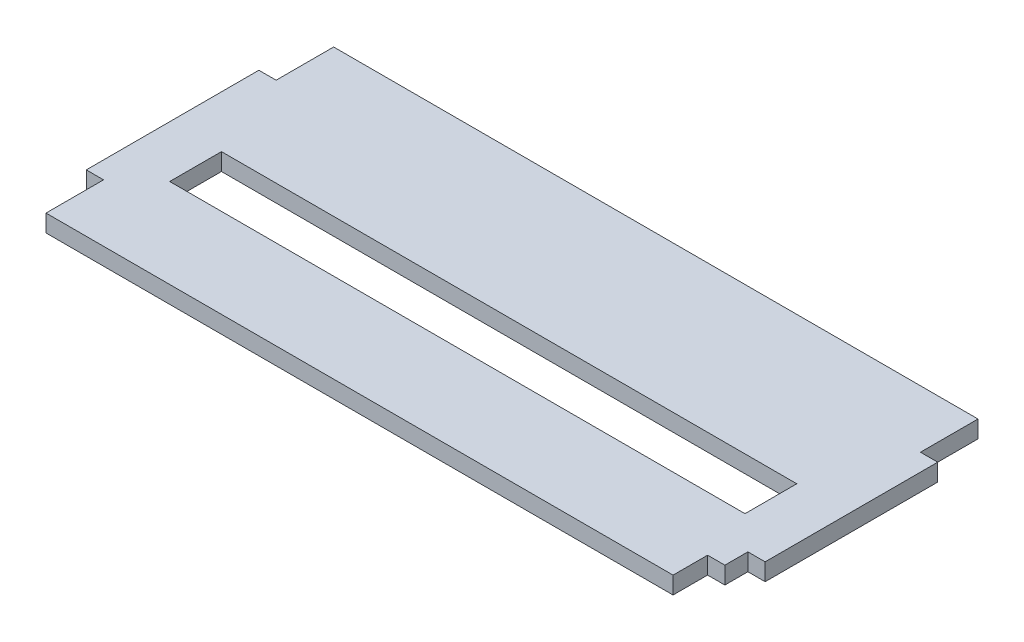
ISO-10303-21;
HEADER;
FILE_DESCRIPTION(('STEP AP214'),'2;1');
FILE_NAME('part.step','',(''),(''),'','','');
FILE_SCHEMA(('AUTOMOTIVE_DESIGN { 1 0 10303 214 1 1 1 1 }'));
ENDSEC;
DATA;
#1=APPLICATION_CONTEXT('core data for automotive mechanical design processes');
#2=APPLICATION_PROTOCOL_DEFINITION('international standard','automotive_design',2000,#1);
#3=PRODUCT_CONTEXT('',#1,'mechanical');
#4=PRODUCT('Part','Part','',(#3));
#5=PRODUCT_RELATED_PRODUCT_CATEGORY('part','',(#4));
#6=PRODUCT_DEFINITION_FORMATION('','',#4);
#7=PRODUCT_DEFINITION_CONTEXT('part definition',#1,'design');
#8=PRODUCT_DEFINITION('design','',#6,#7);
#9=PRODUCT_DEFINITION_SHAPE('','',#8);
#10=(LENGTH_UNIT() NAMED_UNIT(*) SI_UNIT(.MILLI.,.METRE.));
#11=(NAMED_UNIT(*) PLANE_ANGLE_UNIT() SI_UNIT($,.RADIAN.));
#12=(NAMED_UNIT(*) SI_UNIT($,.STERADIAN.) SOLID_ANGLE_UNIT());
#13=UNCERTAINTY_MEASURE_WITH_UNIT(LENGTH_MEASURE(1.E-05),#10,'distance_accuracy_value','');
#14=(GEOMETRIC_REPRESENTATION_CONTEXT(3) GLOBAL_UNCERTAINTY_ASSIGNED_CONTEXT((#13)) GLOBAL_UNIT_ASSIGNED_CONTEXT((#10,
#11,#12)) REPRESENTATION_CONTEXT('',''));
#15=CARTESIAN_POINT('',(0.,0.,0.));
#16=DIRECTION('',(0.,0.,1.));
#17=DIRECTION('',(1.,0.,0.));
#18=AXIS2_PLACEMENT_3D('',#15,#16,#17);
#19=CARTESIAN_POINT('',(-1.55431223447522E-12,12.,139.999999999999));
#20=DIRECTION('',(0.,0.,-1.));
#21=DIRECTION('',(-1.,0.,0.));
#22=AXIS2_PLACEMENT_3D('',#19,#20,#21);
#23=PLANE('',#22);
#24=DIRECTION('',(1.,0.,0.));
#25=VECTOR('',#24,1.);
#26=CARTESIAN_POINT('',(-1.55431223447522E-12,3.,139.999999999999));
#27=LINE('',#26,#25);
#28=CARTESIAN_POINT('',(-3.00000000000156,3.,139.999999999999));
#29=VERTEX_POINT('',#28);
#30=CARTESIAN_POINT('',(-1.55431223447522E-12,3.,139.999999999999));
#31=VERTEX_POINT('',#30);
#32=EDGE_CURVE('E234',#29,#31,#27,.T.);
#33=ORIENTED_EDGE('',*,*,#32,.F.);
#34=DIRECTION('',(0.,1.,0.));
#35=VECTOR('',#34,1.);
#36=CARTESIAN_POINT('',(-3.00000000000156,0.,139.999999999999));
#37=LINE('',#36,#35);
#38=CARTESIAN_POINT('',(-3.00000000000156,0.,139.999999999999));
#39=VERTEX_POINT('',#38);
#40=EDGE_CURVE('E298',#39,#29,#37,.T.);
#41=ORIENTED_EDGE('',*,*,#40,.F.);
#42=DIRECTION('',(1.,0.,0.));
#43=VECTOR('',#42,1.);
#44=CARTESIAN_POINT('',(-1.55431223447522E-12,0.,139.999999999999));
#45=LINE('',#44,#43);
#46=CARTESIAN_POINT('',(-1.55431223447522E-12,0.,139.999999999999));
#47=VERTEX_POINT('',#46);
#48=EDGE_CURVE('E319',#39,#47,#45,.T.);
#49=ORIENTED_EDGE('',*,*,#48,.T.);
#50=DIRECTION('',(0.,1.,0.));
#51=VECTOR('',#50,1.);
#52=CARTESIAN_POINT('',(-1.55431223447522E-12,0.,139.999999999999));
#53=LINE('',#52,#51);
#54=EDGE_CURVE('E261',#47,#31,#53,.T.);
#55=ORIENTED_EDGE('',*,*,#54,.T.);
#56=EDGE_LOOP('',(#33,#41,#49,#55));
#57=FACE_BOUND('',#56,.T.);
#58=ADVANCED_FACE('F40',(#57),#23,.F.);
#59=CARTESIAN_POINT('',(-1.60982338570648E-12,12.,109.999999999999));
#60=DIRECTION('',(0.,0.,-1.));
#61=DIRECTION('',(-1.,0.,0.));
#62=AXIS2_PLACEMENT_3D('',#59,#60,#61);
#63=PLANE('',#62);
#64=DIRECTION('',(0.,1.,0.));
#65=VECTOR('',#64,1.);
#66=CARTESIAN_POINT('',(-2.99999999999845,0.,109.999999999999));
#67=LINE('',#66,#65);
#68=CARTESIAN_POINT('',(-2.99999999999845,0.,109.999999999999));
#69=VERTEX_POINT('',#68);
#70=CARTESIAN_POINT('',(-2.99999999999845,3.,109.999999999999));
#71=VERTEX_POINT('',#70);
#72=EDGE_CURVE('E341',#69,#71,#67,.T.);
#73=ORIENTED_EDGE('',*,*,#72,.T.);
#74=DIRECTION('',(1.,0.,0.));
#75=VECTOR('',#74,1.);
#76=CARTESIAN_POINT('',(-1.60982338570648E-12,3.,109.999999999999));
#77=LINE('',#76,#75);
#78=CARTESIAN_POINT('',(-1.55431223447522E-12,3.,109.999999999999));
#79=VERTEX_POINT('',#78);
#80=EDGE_CURVE('E240',#71,#79,#77,.T.);
#81=ORIENTED_EDGE('',*,*,#80,.T.);
#82=DIRECTION('',(0.,1.,0.));
#83=VECTOR('',#82,1.);
#84=CARTESIAN_POINT('',(-3.33066907387547E-13,0.,109.999999999999));
#85=LINE('',#84,#83);
#86=CARTESIAN_POINT('',(-1.55431223447522E-12,0.,109.999999999999));
#87=VERTEX_POINT('',#86);
#88=EDGE_CURVE('E262',#87,#79,#85,.T.);
#89=ORIENTED_EDGE('',*,*,#88,.F.);
#90=DIRECTION('',(1.,0.,0.));
#91=VECTOR('',#90,1.);
#92=CARTESIAN_POINT('',(-1.60982338570648E-12,0.,109.999999999999));
#93=LINE('',#92,#91);
#94=EDGE_CURVE('E351',#69,#87,#93,.T.);
#95=ORIENTED_EDGE('',*,*,#94,.F.);
#96=EDGE_LOOP('',(#73,#81,#89,#95));
#97=FACE_BOUND('',#96,.T.);
#98=ADVANCED_FACE('F398',(#97),#63,.T.);
#99=CARTESIAN_POINT('',(-118.000000000001,12.,109.999999999999));
#100=DIRECTION('',(0.,0.,1.));
#101=DIRECTION('',(1.,0.,0.));
#102=AXIS2_PLACEMENT_3D('',#99,#100,#101);
#103=PLANE('',#102);
#104=DIRECTION('',(-1.,0.,0.));
#105=VECTOR('',#104,1.);
#106=CARTESIAN_POINT('',(-118.000000000001,3.,109.999999999999));
#107=LINE('',#106,#105);
#108=CARTESIAN_POINT('',(-115.000000000005,3.,109.999999999999));
#109=VERTEX_POINT('',#108);
#110=CARTESIAN_POINT('',(-118.000000000002,3.,109.999999999999));
#111=VERTEX_POINT('',#110);
#112=EDGE_CURVE('E248',#109,#111,#107,.T.);
#113=ORIENTED_EDGE('',*,*,#112,.F.);
#114=DIRECTION('',(0.,1.,0.));
#115=VECTOR('',#114,1.);
#116=CARTESIAN_POINT('',(-115.000000000005,0.,109.999999999999));
#117=LINE('',#116,#115);
#118=CARTESIAN_POINT('',(-115.000000000005,0.,109.999999999999));
#119=VERTEX_POINT('',#118);
#120=EDGE_CURVE('E337',#119,#109,#117,.T.);
#121=ORIENTED_EDGE('',*,*,#120,.F.);
#122=DIRECTION('',(-1.,0.,0.));
#123=VECTOR('',#122,1.);
#124=CARTESIAN_POINT('',(-118.000000000001,0.,109.999999999999));
#125=LINE('',#124,#123);
#126=CARTESIAN_POINT('',(-118.000000000001,0.,109.999999999999));
#127=VERTEX_POINT('',#126);
#128=EDGE_CURVE('E355',#119,#127,#125,.T.);
#129=ORIENTED_EDGE('',*,*,#128,.T.);
#130=DIRECTION('',(0.,1.,0.));
#131=VECTOR('',#130,1.);
#132=CARTESIAN_POINT('',(-118.000000000001,0.,109.999999999999));
#133=LINE('',#132,#131);
#134=EDGE_CURVE('E274',#127,#111,#133,.T.);
#135=ORIENTED_EDGE('',*,*,#134,.T.);
#136=EDGE_LOOP('',(#113,#121,#129,#135));
#137=FACE_BOUND('',#136,.T.);
#138=ADVANCED_FACE('F384',(#137),#103,.F.);
#139=CARTESIAN_POINT('',(-118.000000000002,12.,139.999999999999));
#140=DIRECTION('',(0.,0.,1.));
#141=DIRECTION('',(1.,0.,0.));
#142=AXIS2_PLACEMENT_3D('',#139,#140,#141);
#143=PLANE('',#142);
#144=DIRECTION('',(0.,1.,0.));
#145=VECTOR('',#144,1.);
#146=CARTESIAN_POINT('',(-115.000000000002,0.,139.999999999999));
#147=LINE('',#146,#145);
#148=CARTESIAN_POINT('',(-115.000000000002,0.,139.999999999999));
#149=VERTEX_POINT('',#148);
#150=CARTESIAN_POINT('',(-115.000000000002,3.,139.999999999999));
#151=VERTEX_POINT('',#150);
#152=EDGE_CURVE('E313',#149,#151,#147,.T.);
#153=ORIENTED_EDGE('',*,*,#152,.T.);
#154=DIRECTION('',(-1.,0.,0.));
#155=VECTOR('',#154,1.);
#156=CARTESIAN_POINT('',(-118.000000000002,3.,139.999999999999));
#157=LINE('',#156,#155);
#158=CARTESIAN_POINT('',(-118.000000000002,3.,139.999999999999));
#159=VERTEX_POINT('',#158);
#160=EDGE_CURVE('E254',#151,#159,#157,.T.);
#161=ORIENTED_EDGE('',*,*,#160,.T.);
#162=DIRECTION('',(0.,1.,0.));
#163=VECTOR('',#162,1.);
#164=CARTESIAN_POINT('',(-118.000000000002,0.,139.999999999999));
#165=LINE('',#164,#163);
#166=CARTESIAN_POINT('',(-118.000000000001,0.,139.999999999999));
#167=VERTEX_POINT('',#166);
#168=EDGE_CURVE('E273',#167,#159,#165,.T.);
#169=ORIENTED_EDGE('',*,*,#168,.F.);
#170=DIRECTION('',(-1.,0.,0.));
#171=VECTOR('',#170,1.);
#172=CARTESIAN_POINT('',(-118.000000000002,0.,139.999999999999));
#173=LINE('',#172,#171);
#174=EDGE_CURVE('E359',#149,#167,#173,.T.);
#175=ORIENTED_EDGE('',*,*,#174,.F.);
#176=EDGE_LOOP('',(#153,#161,#169,#175));
#177=FACE_BOUND('',#176,.T.);
#178=ADVANCED_FACE('F377',(#177),#143,.T.);
#179=CARTESIAN_POINT('',(-1.60982338570648E-12,12.,149.999999999999));
#180=DIRECTION('',(0.,0.,1.));
#181=DIRECTION('',(1.,0.,0.));
#182=AXIS2_PLACEMENT_3D('',#179,#180,#181);
#183=PLANE('',#182);
#184=DIRECTION('',(0.,1.,0.));
#185=VECTOR('',#184,1.);
#186=CARTESIAN_POINT('',(-6.00197015274362,0.,149.999999999999));
#187=LINE('',#186,#185);
#188=CARTESIAN_POINT('',(-6.00197015274362,0.,149.999999999999));
#189=VERTEX_POINT('',#188);
#190=CARTESIAN_POINT('',(-6.00197015274362,3.,149.999999999999));
#191=VERTEX_POINT('',#190);
#192=EDGE_CURVE('E302',#189,#191,#187,.T.);
#193=ORIENTED_EDGE('',*,*,#192,.T.);
#194=DIRECTION('',(1.,0.,0.));
#195=VECTOR('',#194,1.);
#196=CARTESIAN_POINT('',(-118.000000000002,3.,149.999999999999));
#197=LINE('',#196,#195);
#198=CARTESIAN_POINT('',(-115.000000000002,3.,149.999999999999));
#199=VERTEX_POINT('',#198);
#200=EDGE_CURVE('E217',#199,#191,#197,.T.);
#201=ORIENTED_EDGE('',*,*,#200,.F.);
#202=DIRECTION('',(0.,1.,0.));
#203=VECTOR('',#202,1.);
#204=CARTESIAN_POINT('',(-115.000000000002,0.,149.999999999999));
#205=LINE('',#204,#203);
#206=CARTESIAN_POINT('',(-115.000000000002,0.,149.999999999999));
#207=VERTEX_POINT('',#206);
#208=EDGE_CURVE('E315',#207,#199,#205,.T.);
#209=ORIENTED_EDGE('',*,*,#208,.F.);
#210=DIRECTION('',(-1.,0.,0.));
#211=VECTOR('',#210,1.);
#212=CARTESIAN_POINT('',(-1.60982338570648E-12,0.,149.999999999999));
#213=LINE('',#212,#211);
#214=EDGE_CURVE('E48',#189,#207,#213,.T.);
#215=ORIENTED_EDGE('',*,*,#214,.F.);
#216=EDGE_LOOP('',(#193,#201,#209,#215));
#217=FACE_BOUND('',#216,.T.);
#218=ADVANCED_FACE('F370',(#217),#183,.T.);
#219=CARTESIAN_POINT('',(-115.000000000002,0.,0.));
#220=DIRECTION('',(1.,0.,0.));
#221=DIRECTION('',(0.,0.,-1.));
#222=AXIS2_PLACEMENT_3D('',#219,#220,#221);
#223=PLANE('',#222);
#224=DIRECTION('',(0.,0.,1.));
#225=VECTOR('',#224,1.);
#226=CARTESIAN_POINT('',(-115.000000000002,3.,0.));
#227=LINE('',#226,#225);
#228=EDGE_CURVE('E251',#151,#199,#227,.T.);
#229=ORIENTED_EDGE('',*,*,#228,.F.);
#230=ORIENTED_EDGE('',*,*,#152,.F.);
#231=DIRECTION('',(0.,0.,-1.));
#232=VECTOR('',#231,1.);
#233=CARTESIAN_POINT('',(-115.000000000002,0.,0.));
#234=LINE('',#233,#232);
#235=EDGE_CURVE('E309',#207,#149,#234,.T.);
#236=ORIENTED_EDGE('',*,*,#235,.F.);
#237=ORIENTED_EDGE('',*,*,#208,.T.);
#238=EDGE_LOOP('',(#229,#230,#236,#237));
#239=FACE_BOUND('',#238,.T.);
#240=ADVANCED_FACE('F374',(#239),#223,.F.);
#241=CARTESIAN_POINT('',(0.,0.,99.9999999999988));
#242=DIRECTION('',(0.,0.,-1.));
#243=DIRECTION('',(-1.,0.,0.));
#244=AXIS2_PLACEMENT_3D('',#241,#242,#243);
#245=PLANE('',#244);
#246=DIRECTION('',(0.,1.,0.));
#247=VECTOR('',#246,1.);
#248=CARTESIAN_POINT('',(-115.000000000005,0.,99.9999999999989));
#249=LINE('',#248,#247);
#250=CARTESIAN_POINT('',(-115.000000000005,0.,99.9999999999989));
#251=VERTEX_POINT('',#250);
#252=CARTESIAN_POINT('',(-115.000000000005,3.,99.9999999999989));
#253=VERTEX_POINT('',#252);
#254=EDGE_CURVE('E314',#251,#253,#249,.T.);
#255=ORIENTED_EDGE('',*,*,#254,.T.);
#256=DIRECTION('',(-1.,0.,0.));
#257=VECTOR('',#256,1.);
#258=CARTESIAN_POINT('',(-118.000000000002,3.,99.9999999999989));
#259=LINE('',#258,#257);
#260=CARTESIAN_POINT('',(-2.9999999999985,3.,99.9999999999989));
#261=VERTEX_POINT('',#260);
#262=EDGE_CURVE('E220',#261,#253,#259,.T.);
#263=ORIENTED_EDGE('',*,*,#262,.F.);
#264=DIRECTION('',(0.,1.,0.));
#265=VECTOR('',#264,1.);
#266=CARTESIAN_POINT('',(-2.9999999999985,0.,99.9999999999989));
#267=LINE('',#266,#265);
#268=CARTESIAN_POINT('',(-2.9999999999985,0.,99.9999999999989));
#269=VERTEX_POINT('',#268);
#270=EDGE_CURVE('E333',#269,#261,#267,.T.);
#271=ORIENTED_EDGE('',*,*,#270,.F.);
#272=DIRECTION('',(-1.,0.,0.));
#273=VECTOR('',#272,1.);
#274=CARTESIAN_POINT('',(0.,0.,99.9999999999988));
#275=LINE('',#274,#273);
#276=EDGE_CURVE('E297',#269,#251,#275,.T.);
#277=ORIENTED_EDGE('',*,*,#276,.T.);
#278=EDGE_LOOP('',(#255,#263,#271,#277));
#279=FACE_BOUND('',#278,.T.);
#280=ADVANCED_FACE('F391',(#279),#245,.T.);
#281=CARTESIAN_POINT('',(-115.000000000005,0.,0.));
#282=DIRECTION('',(-1.,0.,0.));
#283=DIRECTION('',(0.,0.,1.));
#284=AXIS2_PLACEMENT_3D('',#281,#282,#283);
#285=PLANE('',#284);
#286=ORIENTED_EDGE('',*,*,#120,.T.);
#287=DIRECTION('',(0.,0.,-1.));
#288=VECTOR('',#287,1.);
#289=CARTESIAN_POINT('',(-115.000000000005,3.,0.));
#290=LINE('',#289,#288);
#291=EDGE_CURVE('E244',#109,#253,#290,.T.);
#292=ORIENTED_EDGE('',*,*,#291,.T.);
#293=ORIENTED_EDGE('',*,*,#254,.F.);
#294=DIRECTION('',(0.,0.,1.));
#295=VECTOR('',#294,1.);
#296=CARTESIAN_POINT('',(-115.000000000005,0.,0.));
#297=LINE('',#296,#295);
#298=EDGE_CURVE('E329',#251,#119,#297,.T.);
#299=ORIENTED_EDGE('',*,*,#298,.T.);
#300=EDGE_LOOP('',(#286,#292,#293,#299));
#301=FACE_BOUND('',#300,.T.);
#302=ADVANCED_FACE('F386',(#301),#285,.T.);
#303=CARTESIAN_POINT('',(-2.99999999999845,0.,0.));
#304=DIRECTION('',(-1.,0.,0.));
#305=DIRECTION('',(0.,0.,1.));
#306=AXIS2_PLACEMENT_3D('',#303,#304,#305);
#307=PLANE('',#306);
#308=DIRECTION('',(0.,0.,-1.));
#309=VECTOR('',#308,1.);
#310=CARTESIAN_POINT('',(-2.99999999999845,3.,0.));
#311=LINE('',#310,#309);
#312=EDGE_CURVE('E237',#71,#261,#311,.T.);
#313=ORIENTED_EDGE('',*,*,#312,.F.);
#314=ORIENTED_EDGE('',*,*,#72,.F.);
#315=DIRECTION('',(0.,0.,1.));
#316=VECTOR('',#315,1.);
#317=CARTESIAN_POINT('',(-2.99999999999845,0.,0.));
#318=LINE('',#317,#316);
#319=EDGE_CURVE('E325',#269,#69,#318,.T.);
#320=ORIENTED_EDGE('',*,*,#319,.F.);
#321=ORIENTED_EDGE('',*,*,#270,.T.);
#322=EDGE_LOOP('',(#313,#314,#320,#321));
#323=FACE_BOUND('',#322,.T.);
#324=ADVANCED_FACE('F396',(#323),#307,.F.);
#325=CARTESIAN_POINT('',(0.,0.,143.999999999999));
#326=DIRECTION('',(0.,0.,1.));
#327=DIRECTION('',(1.,0.,0.));
#328=AXIS2_PLACEMENT_3D('',#325,#326,#327);
#329=PLANE('',#328);
#330=DIRECTION('',(0.,1.,0.));
#331=VECTOR('',#330,1.);
#332=CARTESIAN_POINT('',(-3.00000000000156,0.,143.999999999999));
#333=LINE('',#332,#331);
#334=CARTESIAN_POINT('',(-3.00000000000156,0.,143.999999999999));
#335=VERTEX_POINT('',#334);
#336=CARTESIAN_POINT('',(-3.00000000000156,3.,143.999999999999));
#337=VERTEX_POINT('',#336);
#338=EDGE_CURVE('E293',#335,#337,#333,.T.);
#339=ORIENTED_EDGE('',*,*,#338,.T.);
#340=DIRECTION('',(-1.,0.,0.));
#341=VECTOR('',#340,1.);
#342=CARTESIAN_POINT('',(0.,3.,143.999999999999));
#343=LINE('',#342,#341);
#344=CARTESIAN_POINT('',(-6.00197015274351,3.,143.999999999999));
#345=VERTEX_POINT('',#344);
#346=EDGE_CURVE('E226',#337,#345,#343,.T.);
#347=ORIENTED_EDGE('',*,*,#346,.T.);
#348=DIRECTION('',(0.,1.,0.));
#349=VECTOR('',#348,1.);
#350=CARTESIAN_POINT('',(-6.00197015274351,0.,143.999999999999));
#351=LINE('',#350,#349);
#352=CARTESIAN_POINT('',(-6.00197015274351,0.,143.999999999999));
#353=VERTEX_POINT('',#352);
#354=EDGE_CURVE('E292',#353,#345,#351,.T.);
#355=ORIENTED_EDGE('',*,*,#354,.F.);
#356=DIRECTION('',(1.,0.,0.));
#357=VECTOR('',#356,1.);
#358=CARTESIAN_POINT('',(0.,0.,143.999999999999));
#359=LINE('',#358,#357);
#360=EDGE_CURVE('E278',#353,#335,#359,.T.);
#361=ORIENTED_EDGE('',*,*,#360,.T.);
#362=EDGE_LOOP('',(#339,#347,#355,#361));
#363=FACE_BOUND('',#362,.T.);
#364=ADVANCED_FACE('F410',(#363),#329,.T.);
#365=CARTESIAN_POINT('',(-3.00000000000156,0.,0.));
#366=DIRECTION('',(1.,0.,0.));
#367=DIRECTION('',(0.,0.,-1.));
#368=AXIS2_PLACEMENT_3D('',#365,#366,#367);
#369=PLANE('',#368);
#370=ORIENTED_EDGE('',*,*,#40,.T.);
#371=DIRECTION('',(0.,0.,1.));
#372=VECTOR('',#371,1.);
#373=CARTESIAN_POINT('',(-3.00000000000156,3.,0.));
#374=LINE('',#373,#372);
#375=EDGE_CURVE('E230',#29,#337,#374,.T.);
#376=ORIENTED_EDGE('',*,*,#375,.T.);
#377=ORIENTED_EDGE('',*,*,#338,.F.);
#378=DIRECTION('',(0.,0.,-1.));
#379=VECTOR('',#378,1.);
#380=CARTESIAN_POINT('',(-3.00000000000156,0.,0.));
#381=LINE('',#380,#379);
#382=EDGE_CURVE('E288',#335,#39,#381,.T.);
#383=ORIENTED_EDGE('',*,*,#382,.T.);
#384=EDGE_LOOP('',(#370,#376,#377,#383));
#385=FACE_BOUND('',#384,.T.);
#386=ADVANCED_FACE('F407',(#385),#369,.T.);
#387=CARTESIAN_POINT('',(-6.00197015274356,0.,0.));
#388=DIRECTION('',(-1.,0.,0.));
#389=DIRECTION('',(0.,0.,1.));
#390=AXIS2_PLACEMENT_3D('',#387,#388,#389);
#391=PLANE('',#390);
#392=DIRECTION('',(0.,0.,-1.));
#393=VECTOR('',#392,1.);
#394=CARTESIAN_POINT('',(-6.00197015274356,3.,0.));
#395=LINE('',#394,#393);
#396=EDGE_CURVE('E223',#191,#345,#395,.T.);
#397=ORIENTED_EDGE('',*,*,#396,.F.);
#398=ORIENTED_EDGE('',*,*,#192,.F.);
#399=DIRECTION('',(0.,0.,1.));
#400=VECTOR('',#399,1.);
#401=CARTESIAN_POINT('',(-6.00197015274356,0.,0.));
#402=LINE('',#401,#400);
#403=EDGE_CURVE('E284',#353,#189,#402,.T.);
#404=ORIENTED_EDGE('',*,*,#403,.F.);
#405=ORIENTED_EDGE('',*,*,#354,.T.);
#406=EDGE_LOOP('',(#397,#398,#404,#405));
#407=FACE_BOUND('',#406,.T.);
#408=ADVANCED_FACE('F413',(#407),#391,.F.);
#409=CARTESIAN_POINT('',(-118.000000000002,0.,0.));
#410=DIRECTION('',(1.,0.,0.));
#411=DIRECTION('',(0.,0.,-1.));
#412=AXIS2_PLACEMENT_3D('',#409,#410,#411);
#413=PLANE('',#412);
#414=DIRECTION('',(0.,0.,1.));
#415=VECTOR('',#414,1.);
#416=CARTESIAN_POINT('',(-118.000000000002,3.,99.9999999999989));
#417=LINE('',#416,#415);
#418=EDGE_CURVE('E209',#111,#159,#417,.T.);
#419=ORIENTED_EDGE('',*,*,#418,.F.);
#420=ORIENTED_EDGE('',*,*,#134,.F.);
#421=DIRECTION('',(0.,0.,-1.));
#422=VECTOR('',#421,1.);
#423=CARTESIAN_POINT('',(-118.000000000002,0.,0.));
#424=LINE('',#423,#422);
#425=EDGE_CURVE('E266',#167,#127,#424,.T.);
#426=ORIENTED_EDGE('',*,*,#425,.F.);
#427=ORIENTED_EDGE('',*,*,#168,.T.);
#428=EDGE_LOOP('',(#419,#420,#426,#427));
#429=FACE_BOUND('',#428,.T.);
#430=ADVANCED_FACE('F417',(#429),#413,.F.);
#431=CARTESIAN_POINT('',(0.,0.,0.));
#432=DIRECTION('',(1.,0.,0.));
#433=DIRECTION('',(0.,0.,-1.));
#434=AXIS2_PLACEMENT_3D('',#431,#432,#433);
#435=PLANE('',#434);
#436=ORIENTED_EDGE('',*,*,#88,.T.);
#437=DIRECTION('',(0.,0.,1.));
#438=VECTOR('',#437,1.);
#439=CARTESIAN_POINT('',(0.,3.,0.));
#440=LINE('',#439,#438);
#441=EDGE_CURVE('E11',#79,#31,#440,.T.);
#442=ORIENTED_EDGE('',*,*,#441,.T.);
#443=ORIENTED_EDGE('',*,*,#54,.F.);
#444=DIRECTION('',(0.,0.,-1.));
#445=VECTOR('',#444,1.);
#446=CARTESIAN_POINT('',(0.,0.,0.));
#447=LINE('',#446,#445);
#448=EDGE_CURVE('E258',#47,#87,#447,.T.);
#449=ORIENTED_EDGE('',*,*,#448,.T.);
#450=EDGE_LOOP('',(#436,#442,#443,#449));
#451=FACE_BOUND('',#450,.T.);
#452=ADVANCED_FACE('F419',(#451),#435,.T.);
#453=CARTESIAN_POINT('',(0.,0.,0.));
#454=DIRECTION('',(0.,-1.,0.));
#455=DIRECTION('',(0.,0.,-1.));
#456=AXIS2_PLACEMENT_3D('',#453,#454,#455);
#457=PLANE('',#456);
#458=DIRECTION('',(0.,0.,-1.));
#459=VECTOR('',#458,1.);
#460=CARTESIAN_POINT('',(-9.00000000000156,0.,125.499999999999));
#461=LINE('',#460,#459);
#462=CARTESIAN_POINT('',(-9.00000000000162,0.,134.499999999999));
#463=VERTEX_POINT('',#462);
#464=CARTESIAN_POINT('',(-9.00000000000156,0.,125.499999999999));
#465=VERTEX_POINT('',#464);
#466=EDGE_CURVE('E167',#463,#465,#461,.T.);
#467=ORIENTED_EDGE('',*,*,#466,.T.);
#468=DIRECTION('',(-1.,0.,0.));
#469=VECTOR('',#468,1.);
#470=CARTESIAN_POINT('',(-109.000000000002,0.,125.499999999999));
#471=LINE('',#470,#469);
#472=CARTESIAN_POINT('',(-109.000000000002,0.,125.499999999999));
#473=VERTEX_POINT('',#472);
#474=EDGE_CURVE('E177',#465,#473,#471,.T.);
#475=ORIENTED_EDGE('',*,*,#474,.T.);
#476=DIRECTION('',(0.,0.,1.));
#477=VECTOR('',#476,1.);
#478=CARTESIAN_POINT('',(-109.000000000002,0.,125.499999999999));
#479=LINE('',#478,#477);
#480=CARTESIAN_POINT('',(-109.000000000002,0.,134.499999999999));
#481=VERTEX_POINT('',#480);
#482=EDGE_CURVE('E55',#473,#481,#479,.T.);
#483=ORIENTED_EDGE('',*,*,#482,.T.);
#484=DIRECTION('',(1.,0.,0.));
#485=VECTOR('',#484,1.);
#486=CARTESIAN_POINT('',(-109.000000000002,0.,134.499999999999));
#487=LINE('',#486,#485);
#488=EDGE_CURVE('E174',#481,#463,#487,.T.);
#489=ORIENTED_EDGE('',*,*,#488,.T.);
#490=EDGE_LOOP('',(#467,#475,#483,#489));
#491=FACE_BOUND('',#490,.T.);
#492=ORIENTED_EDGE('',*,*,#94,.T.);
#493=ORIENTED_EDGE('',*,*,#448,.F.);
#494=ORIENTED_EDGE('',*,*,#48,.F.);
#495=ORIENTED_EDGE('',*,*,#382,.F.);
#496=ORIENTED_EDGE('',*,*,#360,.F.);
#497=ORIENTED_EDGE('',*,*,#403,.T.);
#498=ORIENTED_EDGE('',*,*,#214,.T.);
#499=ORIENTED_EDGE('',*,*,#235,.T.);
#500=ORIENTED_EDGE('',*,*,#174,.T.);
#501=ORIENTED_EDGE('',*,*,#425,.T.);
#502=ORIENTED_EDGE('',*,*,#128,.F.);
#503=ORIENTED_EDGE('',*,*,#298,.F.);
#504=ORIENTED_EDGE('',*,*,#276,.F.);
#505=ORIENTED_EDGE('',*,*,#319,.T.);
#506=EDGE_LOOP('',(#492,#493,#494,#495,#496,#497,#498,#499,#500,#501,#502,#503,#504,#505));
#507=FACE_BOUND('',#506,.T.);
#508=ADVANCED_FACE('F182',(#491,#507),#457,.T.);
#509=CARTESIAN_POINT('',(0.,3.,0.));
#510=DIRECTION('',(0.,1.,0.));
#511=DIRECTION('',(0.,0.,1.));
#512=AXIS2_PLACEMENT_3D('',#509,#510,#511);
#513=PLANE('',#512);
#514=DIRECTION('',(0.,0.,-1.));
#515=VECTOR('',#514,1.);
#516=CARTESIAN_POINT('',(-9.00000000000156,3.,125.499999999999));
#517=LINE('',#516,#515);
#518=CARTESIAN_POINT('',(-9.00000000000162,3.,134.499999999999));
#519=VERTEX_POINT('',#518);
#520=CARTESIAN_POINT('',(-9.00000000000156,3.,125.499999999999));
#521=VERTEX_POINT('',#520);
#522=EDGE_CURVE('E63',#519,#521,#517,.T.);
#523=ORIENTED_EDGE('',*,*,#522,.F.);
#524=DIRECTION('',(1.,0.,0.));
#525=VECTOR('',#524,1.);
#526=CARTESIAN_POINT('',(-109.000000000002,3.,134.499999999999));
#527=LINE('',#526,#525);
#528=CARTESIAN_POINT('',(-109.000000000002,3.,134.499999999999));
#529=VERTEX_POINT('',#528);
#530=EDGE_CURVE('E186',#529,#519,#527,.T.);
#531=ORIENTED_EDGE('',*,*,#530,.F.);
#532=DIRECTION('',(0.,0.,1.));
#533=VECTOR('',#532,1.);
#534=CARTESIAN_POINT('',(-109.000000000002,3.,125.499999999999));
#535=LINE('',#534,#533);
#536=CARTESIAN_POINT('',(-109.000000000002,3.,125.499999999999));
#537=VERTEX_POINT('',#536);
#538=EDGE_CURVE('E191',#537,#529,#535,.T.);
#539=ORIENTED_EDGE('',*,*,#538,.F.);
#540=DIRECTION('',(-1.,0.,0.));
#541=VECTOR('',#540,1.);
#542=CARTESIAN_POINT('',(-109.000000000002,3.,125.499999999999));
#543=LINE('',#542,#541);
#544=EDGE_CURVE('E200',#521,#537,#543,.T.);
#545=ORIENTED_EDGE('',*,*,#544,.F.);
#546=EDGE_LOOP('',(#523,#531,#539,#545));
#547=FACE_BOUND('',#546,.T.);
#548=ORIENTED_EDGE('',*,*,#228,.T.);
#549=ORIENTED_EDGE('',*,*,#200,.T.);
#550=ORIENTED_EDGE('',*,*,#396,.T.);
#551=ORIENTED_EDGE('',*,*,#346,.F.);
#552=ORIENTED_EDGE('',*,*,#375,.F.);
#553=ORIENTED_EDGE('',*,*,#32,.T.);
#554=ORIENTED_EDGE('',*,*,#441,.F.);
#555=ORIENTED_EDGE('',*,*,#80,.F.);
#556=ORIENTED_EDGE('',*,*,#312,.T.);
#557=ORIENTED_EDGE('',*,*,#262,.T.);
#558=ORIENTED_EDGE('',*,*,#291,.F.);
#559=ORIENTED_EDGE('',*,*,#112,.T.);
#560=ORIENTED_EDGE('',*,*,#418,.T.);
#561=ORIENTED_EDGE('',*,*,#160,.F.);
#562=EDGE_LOOP('',(#548,#549,#550,#551,#552,#553,#554,#555,#556,#557,#558,#559,#560,#561));
#563=FACE_BOUND('',#562,.T.);
#564=ADVANCED_FACE('F415',(#547,#563),#513,.T.);
#565=CARTESIAN_POINT('',(-9.00000000000156,0.,125.499999999999));
#566=DIRECTION('',(1.,0.,0.));
#567=DIRECTION('',(0.,0.,-1.));
#568=AXIS2_PLACEMENT_3D('',#565,#566,#567);
#569=PLANE('',#568);
#570=ORIENTED_EDGE('',*,*,#522,.T.);
#571=DIRECTION('',(0.,1.,0.));
#572=VECTOR('',#571,1.);
#573=CARTESIAN_POINT('',(-9.00000000000156,0.,125.499999999999));
#574=LINE('',#573,#572);
#575=EDGE_CURVE('E163',#465,#521,#574,.T.);
#576=ORIENTED_EDGE('',*,*,#575,.F.);
#577=ORIENTED_EDGE('',*,*,#466,.F.);
#578=DIRECTION('',(0.,1.,0.));
#579=VECTOR('',#578,1.);
#580=CARTESIAN_POINT('',(-9.00000000000162,0.,134.499999999999));
#581=LINE('',#580,#579);
#582=EDGE_CURVE('E206',#463,#519,#581,.T.);
#583=ORIENTED_EDGE('',*,*,#582,.T.);
#584=EDGE_LOOP('',(#570,#576,#577,#583));
#585=FACE_BOUND('',#584,.T.);
#586=ADVANCED_FACE('F165',(#585),#569,.F.);
#587=CARTESIAN_POINT('',(-109.000000000002,0.,134.499999999999));
#588=DIRECTION('',(0.,0.,1.));
#589=DIRECTION('',(1.,0.,0.));
#590=AXIS2_PLACEMENT_3D('',#587,#588,#589);
#591=PLANE('',#590);
#592=ORIENTED_EDGE('',*,*,#530,.T.);
#593=ORIENTED_EDGE('',*,*,#582,.F.);
#594=ORIENTED_EDGE('',*,*,#488,.F.);
#595=DIRECTION('',(0.,1.,0.));
#596=VECTOR('',#595,1.);
#597=CARTESIAN_POINT('',(-109.000000000002,0.,134.499999999999));
#598=LINE('',#597,#596);
#599=EDGE_CURVE('E210',#481,#529,#598,.T.);
#600=ORIENTED_EDGE('',*,*,#599,.T.);
#601=EDGE_LOOP('',(#592,#593,#594,#600));
#602=FACE_BOUND('',#601,.T.);
#603=ADVANCED_FACE('F495',(#602),#591,.F.);
#604=CARTESIAN_POINT('',(-109.000000000002,0.,125.499999999999));
#605=DIRECTION('',(-1.,0.,0.));
#606=DIRECTION('',(0.,0.,1.));
#607=AXIS2_PLACEMENT_3D('',#604,#605,#606);
#608=PLANE('',#607);
#609=ORIENTED_EDGE('',*,*,#538,.T.);
#610=ORIENTED_EDGE('',*,*,#599,.F.);
#611=ORIENTED_EDGE('',*,*,#482,.F.);
#612=DIRECTION('',(0.,1.,0.));
#613=VECTOR('',#612,1.);
#614=CARTESIAN_POINT('',(-109.000000000002,0.,125.499999999999));
#615=LINE('',#614,#613);
#616=EDGE_CURVE('E173',#473,#537,#615,.T.);
#617=ORIENTED_EDGE('',*,*,#616,.T.);
#618=EDGE_LOOP('',(#609,#610,#611,#617));
#619=FACE_BOUND('',#618,.T.);
#620=ADVANCED_FACE('F504',(#619),#608,.F.);
#621=CARTESIAN_POINT('',(-109.000000000002,0.,125.499999999999));
#622=DIRECTION('',(0.,0.,-1.));
#623=DIRECTION('',(-1.,0.,0.));
#624=AXIS2_PLACEMENT_3D('',#621,#622,#623);
#625=PLANE('',#624);
#626=ORIENTED_EDGE('',*,*,#544,.T.);
#627=ORIENTED_EDGE('',*,*,#616,.F.);
#628=ORIENTED_EDGE('',*,*,#474,.F.);
#629=ORIENTED_EDGE('',*,*,#575,.T.);
#630=EDGE_LOOP('',(#626,#627,#628,#629));
#631=FACE_BOUND('',#630,.T.);
#632=ADVANCED_FACE('F178',(#631),#625,.F.);
#633=CLOSED_SHELL('',(#58,#98,#138,#178,#218,#240,#280,#302,#324,#364,#386,#408,#430,#452,#508,
#564,#586,#603,#620,#632));
#634=MANIFOLD_SOLID_BREP('B2',#633);
#635=ADVANCED_BREP_SHAPE_REPRESENTATION('',(#18,#634),#14);
#636=SHAPE_DEFINITION_REPRESENTATION(#9,#635);
ENDSEC;
END-ISO-10303-21;
